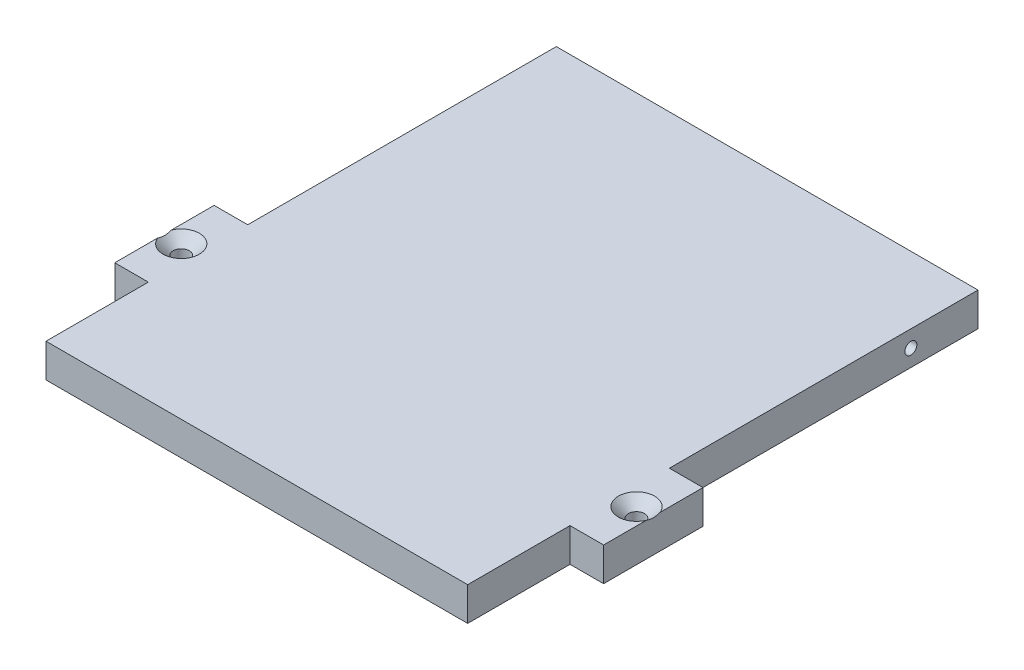
ISO-10303-21;
HEADER;
FILE_DESCRIPTION(('STEP AP214'),'2;1');
FILE_NAME('part.step','',(''),(''),'','','');
FILE_SCHEMA(('AUTOMOTIVE_DESIGN { 1 0 10303 214 1 1 1 1 }'));
ENDSEC;
DATA;
#1=APPLICATION_CONTEXT('core data for automotive mechanical design processes');
#2=APPLICATION_PROTOCOL_DEFINITION('international standard','automotive_design',2000,#1);
#3=PRODUCT_CONTEXT('',#1,'mechanical');
#4=PRODUCT('Part','Part','',(#3));
#5=PRODUCT_RELATED_PRODUCT_CATEGORY('part','',(#4));
#6=PRODUCT_DEFINITION_FORMATION('','',#4);
#7=PRODUCT_DEFINITION_CONTEXT('part definition',#1,'design');
#8=PRODUCT_DEFINITION('design','',#6,#7);
#9=PRODUCT_DEFINITION_SHAPE('','',#8);
#10=(LENGTH_UNIT() NAMED_UNIT(*) SI_UNIT(.MILLI.,.METRE.));
#11=(NAMED_UNIT(*) PLANE_ANGLE_UNIT() SI_UNIT($,.RADIAN.));
#12=(NAMED_UNIT(*) SI_UNIT($,.STERADIAN.) SOLID_ANGLE_UNIT());
#13=UNCERTAINTY_MEASURE_WITH_UNIT(LENGTH_MEASURE(1.E-05),#10,'distance_accuracy_value','');
#14=(GEOMETRIC_REPRESENTATION_CONTEXT(3) GLOBAL_UNCERTAINTY_ASSIGNED_CONTEXT((#13)) GLOBAL_UNIT_ASSIGNED_CONTEXT((#10,
#11,#12)) REPRESENTATION_CONTEXT('',''));
#15=CARTESIAN_POINT('',(0.,0.,0.));
#16=DIRECTION('',(0.,0.,1.));
#17=DIRECTION('',(1.,0.,0.));
#18=AXIS2_PLACEMENT_3D('',#15,#16,#17);
#19=CARTESIAN_POINT('',(39.6883770008071,6.35,-47.3190082823018));
#20=DIRECTION('',(1.,0.,0.));
#21=DIRECTION('',(0.,0.,-1.));
#22=AXIS2_PLACEMENT_3D('',#19,#20,#21);
#23=PLANE('',#22);
#24=DIRECTION('',(0.,0.,1.));
#25=VECTOR('',#24,1.);
#26=CARTESIAN_POINT('',(39.6883770008071,0.,-47.3190082823018));
#27=LINE('',#26,#25);
#28=CARTESIAN_POINT('',(39.6883770008071,0.,-96.2364061321356));
#29=VERTEX_POINT('',#28);
#30=CARTESIAN_POINT('',(39.688377000807,0.,-37.8672061321356));
#31=VERTEX_POINT('',#30);
#32=EDGE_CURVE('E333',#29,#31,#27,.T.);
#33=ORIENTED_EDGE('',*,*,#32,.F.);
#34=DIRECTION('',(0.,-1.,0.));
#35=VECTOR('',#34,1.);
#36=CARTESIAN_POINT('',(39.6883770008071,6.35,-96.2364061321356));
#37=LINE('',#36,#35);
#38=CARTESIAN_POINT('',(39.6883770008071,6.35,-96.2364061321356));
#39=VERTEX_POINT('',#38);
#40=EDGE_CURVE('E304',#39,#29,#37,.T.);
#41=ORIENTED_EDGE('',*,*,#40,.F.);
#42=DIRECTION('',(0.,0.,1.));
#43=VECTOR('',#42,1.);
#44=CARTESIAN_POINT('',(39.6883770008071,6.35,-47.3190082823018));
#45=LINE('',#44,#43);
#46=CARTESIAN_POINT('',(39.688377000807,6.35,-37.8672061321356));
#47=VERTEX_POINT('',#46);
#48=EDGE_CURVE('E157',#39,#47,#45,.T.);
#49=ORIENTED_EDGE('',*,*,#48,.T.);
#50=DIRECTION('',(0.,-1.,0.));
#51=VECTOR('',#50,1.);
#52=CARTESIAN_POINT('',(39.688377000807,6.35,-37.8672061321356));
#53=LINE('',#52,#51);
#54=EDGE_CURVE('E342',#47,#31,#53,.T.);
#55=ORIENTED_EDGE('',*,*,#54,.T.);
#56=EDGE_LOOP('',(#33,#41,#49,#55));
#57=FACE_BOUND('',#56,.T.);
#58=CARTESIAN_POINT('',(39.6883770008072,3.175,-83.5364061321355));
#59=DIRECTION('',(1.,0.,0.));
#60=DIRECTION('',(0.,0.,-1.));
#61=AXIS2_PLACEMENT_3D('',#58,#59,#60);
#62=CIRCLE('',#61,1.13029999999999);
#63=CARTESIAN_POINT('',(39.6883770008072,3.175,-84.6667061321355));
#64=VERTEX_POINT('',#63);
#65=EDGE_CURVE('E40',#64,#64,#62,.F.);
#66=ORIENTED_EDGE('',*,*,#65,.T.);
#67=EDGE_LOOP('',(#66));
#68=FACE_BOUND('',#67,.T.);
#69=ADVANCED_FACE('F35',(#57,#68),#23,.T.);
#70=CARTESIAN_POINT('',(-102.547126508136,6.35,-96.2364061321356));
#71=DIRECTION('',(0.,0.,1.));
#72=DIRECTION('',(1.,0.,0.));
#73=AXIS2_PLACEMENT_3D('',#70,#71,#72);
#74=PLANE('',#73);
#75=DIRECTION('',(-1.,0.,0.));
#76=VECTOR('',#75,1.);
#77=CARTESIAN_POINT('',(-102.547126508136,0.,-96.2364061321356));
#78=LINE('',#77,#76);
#79=CARTESIAN_POINT('',(-40.0676229991929,0.,-96.2364061321356));
#80=VERTEX_POINT('',#79);
#81=EDGE_CURVE('E163',#29,#80,#78,.T.);
#82=ORIENTED_EDGE('',*,*,#81,.T.);
#83=DIRECTION('',(0.,-1.,0.));
#84=VECTOR('',#83,1.);
#85=CARTESIAN_POINT('',(-40.0676229991929,6.35,-96.2364061321356));
#86=LINE('',#85,#84);
#87=CARTESIAN_POINT('',(-40.0676229991929,6.35,-96.2364061321356));
#88=VERTEX_POINT('',#87);
#89=EDGE_CURVE('E142',#88,#80,#86,.T.);
#90=ORIENTED_EDGE('',*,*,#89,.F.);
#91=DIRECTION('',(-1.,0.,0.));
#92=VECTOR('',#91,1.);
#93=CARTESIAN_POINT('',(-102.547126508136,6.35,-96.2364061321356));
#94=LINE('',#93,#92);
#95=EDGE_CURVE('E150',#39,#88,#94,.T.);
#96=ORIENTED_EDGE('',*,*,#95,.F.);
#97=ORIENTED_EDGE('',*,*,#40,.T.);
#98=EDGE_LOOP('',(#82,#90,#96,#97));
#99=FACE_BOUND('',#98,.T.);
#100=ADVANCED_FACE('F161',(#99),#74,.F.);
#101=CARTESIAN_POINT('',(-40.0676229991929,6.35,-47.3190082823024));
#102=DIRECTION('',(1.,0.,0.));
#103=DIRECTION('',(0.,0.,-1.));
#104=AXIS2_PLACEMENT_3D('',#101,#102,#103);
#105=PLANE('',#104);
#106=CARTESIAN_POINT('',(-40.0676229991929,3.175,-83.5364061321355));
#107=DIRECTION('',(-1.,0.,0.));
#108=DIRECTION('',(0.,0.,1.));
#109=AXIS2_PLACEMENT_3D('',#106,#107,#108);
#110=CIRCLE('',#109,1.13029999999999);
#111=CARTESIAN_POINT('',(-40.0676229991929,3.175,-82.4061061321356));
#112=VERTEX_POINT('',#111);
#113=EDGE_CURVE('E273',#112,#112,#110,.T.);
#114=ORIENTED_EDGE('',*,*,#113,.F.);
#115=EDGE_LOOP('',(#114));
#116=FACE_BOUND('',#115,.T.);
#117=DIRECTION('',(0.,0.,1.));
#118=VECTOR('',#117,1.);
#119=CARTESIAN_POINT('',(-40.0676229991929,0.,-47.3190082823024));
#120=LINE('',#119,#118);
#121=CARTESIAN_POINT('',(-40.0676229991928,0.,-37.8672061321356));
#122=VERTEX_POINT('',#121);
#123=EDGE_CURVE('E306',#80,#122,#120,.T.);
#124=ORIENTED_EDGE('',*,*,#123,.T.);
#125=DIRECTION('',(0.,-1.,0.));
#126=VECTOR('',#125,1.);
#127=CARTESIAN_POINT('',(-40.0676229991928,6.35,-37.8672061321356));
#128=LINE('',#127,#126);
#129=CARTESIAN_POINT('',(-40.0676229991928,6.35,-37.8672061321356));
#130=VERTEX_POINT('',#129);
#131=EDGE_CURVE('E145',#130,#122,#128,.T.);
#132=ORIENTED_EDGE('',*,*,#131,.F.);
#133=DIRECTION('',(0.,0.,1.));
#134=VECTOR('',#133,1.);
#135=CARTESIAN_POINT('',(-40.0676229991929,6.35,-47.3190082823024));
#136=LINE('',#135,#134);
#137=EDGE_CURVE('E138',#88,#130,#136,.T.);
#138=ORIENTED_EDGE('',*,*,#137,.F.);
#139=ORIENTED_EDGE('',*,*,#89,.T.);
#140=EDGE_LOOP('',(#124,#132,#138,#139));
#141=FACE_BOUND('',#140,.T.);
#142=ADVANCED_FACE('F140',(#116,#141),#105,.F.);
#143=CARTESIAN_POINT('',(-102.547126508136,6.35,-37.8672061321356));
#144=DIRECTION('',(0.,0.,1.));
#145=DIRECTION('',(1.,0.,0.));
#146=AXIS2_PLACEMENT_3D('',#143,#144,#145);
#147=PLANE('',#146);
#148=DIRECTION('',(-1.,0.,0.));
#149=VECTOR('',#148,1.);
#150=CARTESIAN_POINT('',(-102.547126508136,0.,-37.8672061321356));
#151=LINE('',#150,#149);
#152=CARTESIAN_POINT('',(-46.4176229991928,0.,-37.8672061321356));
#153=VERTEX_POINT('',#152);
#154=EDGE_CURVE('E308',#122,#153,#151,.T.);
#155=ORIENTED_EDGE('',*,*,#154,.T.);
#156=DIRECTION('',(0.,-1.,0.));
#157=VECTOR('',#156,1.);
#158=CARTESIAN_POINT('',(-46.4176229991928,6.35,-37.8672061321356));
#159=LINE('',#158,#157);
#160=CARTESIAN_POINT('',(-46.4176229991928,6.35,-37.8672061321356));
#161=VERTEX_POINT('',#160);
#162=EDGE_CURVE('E169',#161,#153,#159,.T.);
#163=ORIENTED_EDGE('',*,*,#162,.F.);
#164=DIRECTION('',(-1.,0.,0.));
#165=VECTOR('',#164,1.);
#166=CARTESIAN_POINT('',(-102.547126508136,6.35,-37.8672061321356));
#167=LINE('',#166,#165);
#168=EDGE_CURVE('E149',#130,#161,#167,.T.);
#169=ORIENTED_EDGE('',*,*,#168,.F.);
#170=ORIENTED_EDGE('',*,*,#131,.T.);
#171=EDGE_LOOP('',(#155,#163,#169,#170));
#172=FACE_BOUND('',#171,.T.);
#173=ADVANCED_FACE('F219',(#172),#147,.F.);
#174=CARTESIAN_POINT('',(-46.4176229991928,6.35,-47.3190082823023));
#175=DIRECTION('',(-1.,0.,0.));
#176=DIRECTION('',(0.,0.,1.));
#177=AXIS2_PLACEMENT_3D('',#174,#175,#176);
#178=PLANE('',#177);
#179=DIRECTION('',(0.,0.,-1.));
#180=VECTOR('',#179,1.);
#181=CARTESIAN_POINT('',(-46.4176229991928,6.35,-47.3190082823023));
#182=LINE('',#181,#180);
#183=CARTESIAN_POINT('',(-46.4176229991929,6.35,-19.0712061321356));
#184=VERTEX_POINT('',#183);
#185=CARTESIAN_POINT('',(-46.4176229991928,6.35,-27.174055175683));
#186=VERTEX_POINT('',#185);
#187=EDGE_CURVE('E282',#184,#186,#182,.T.);
#188=ORIENTED_EDGE('',*,*,#187,.T.);
#189=CARTESIAN_POINT('',(-46.4176229991928,6.35,-27.174055175683));
#190=CARTESIAN_POINT('',(-46.4176229991928,6.31111456805667,-27.2769388961666));
#191=CARTESIAN_POINT('',(-46.4176229991928,6.27570288432137,-27.3812603931163));
#192=CARTESIAN_POINT('',(-46.4176229991928,6.21323262229652,-27.5926541140827));
#193=CARTESIAN_POINT('',(-46.4176229991928,6.18619614019412,-27.6997328206307));
#194=CARTESIAN_POINT('',(-46.4176229991928,6.14288691578827,-27.9121195594745));
#195=CARTESIAN_POINT('',(-46.4176229991928,6.12626484364899,-28.0173546516018));
#196=CARTESIAN_POINT('',(-46.4176229991928,6.10335509585119,-28.228823161426));
#197=CARTESIAN_POINT('',(-46.4176229991928,6.09705404783173,-28.3350551076859));
#198=CARTESIAN_POINT('',(-46.4176229991928,6.09515139753152,-28.552087665572));
#199=CARTESIAN_POINT('',(-46.4176229991928,6.10001056558474,-28.6628926598915));
#200=CARTESIAN_POINT('',(-46.4176229991928,6.12103457209278,-28.8835631375796));
#201=CARTESIAN_POINT('',(-46.4176229991928,6.13721555492847,-28.9934270522855));
#202=CARTESIAN_POINT('',(-46.4176229991928,6.18059889062465,-29.2152961394401));
#203=CARTESIAN_POINT('',(-46.4176229991928,6.20820141409091,-29.3272210129955));
#204=CARTESIAN_POINT('',(-46.4176229991928,6.27262414248632,-29.5480713437992));
#205=CARTESIAN_POINT('',(-46.4176229991928,6.30941862852149,-29.6570042440712));
#206=CARTESIAN_POINT('',(-46.4176229991928,6.35,-29.7643570885882));
#207=B_SPLINE_CURVE_WITH_KNOTS('',3,(#189,#190,#191,#192,#193,#194,#195,#196,#197,#198,#199,
#200,#201,#202,#203,#204,#205,#206),.UNSPECIFIED.,.F.,.F.,(4,2,2,2,2,2,2,2,4),(0.,
0.330075385219527,0.661014329794229,0.980156657333872,1.29888516238657,1.63100817160978,
1.96360574050835,2.30900260410894,2.65344367215088),.UNSPECIFIED.);
#208=CARTESIAN_POINT('',(-46.4176229991928,6.35,-29.7643570885882));
#209=VERTEX_POINT('',#208);
#210=EDGE_CURVE('E45',#186,#209,#207,.T.);
#211=ORIENTED_EDGE('',*,*,#210,.T.);
#212=EDGE_CURVE('E281',#209,#161,#182,.T.);
#213=ORIENTED_EDGE('',*,*,#212,.T.);
#214=ORIENTED_EDGE('',*,*,#162,.T.);
#215=DIRECTION('',(0.,0.,-1.));
#216=VECTOR('',#215,1.);
#217=CARTESIAN_POINT('',(-46.4176229991928,0.,-47.3190082823023));
#218=LINE('',#217,#216);
#219=CARTESIAN_POINT('',(-46.4176229991929,0.,-19.0712061321356));
#220=VERTEX_POINT('',#219);
#221=EDGE_CURVE('E311',#220,#153,#218,.T.);
#222=ORIENTED_EDGE('',*,*,#221,.F.);
#223=DIRECTION('',(0.,-1.,0.));
#224=VECTOR('',#223,1.);
#225=CARTESIAN_POINT('',(-46.4176229991929,6.35,-19.0712061321356));
#226=LINE('',#225,#224);
#227=EDGE_CURVE('E358',#184,#220,#226,.T.);
#228=ORIENTED_EDGE('',*,*,#227,.F.);
#229=EDGE_LOOP('',(#188,#211,#213,#214,#222,#228));
#230=FACE_BOUND('',#229,.T.);
#231=ADVANCED_FACE('F214',(#230),#178,.T.);
#232=CARTESIAN_POINT('',(-102.547126508136,6.35,-19.0712061321356));
#233=DIRECTION('',(0.,0.,-1.));
#234=DIRECTION('',(-1.,0.,0.));
#235=AXIS2_PLACEMENT_3D('',#232,#233,#234);
#236=PLANE('',#235);
#237=DIRECTION('',(1.,0.,0.));
#238=VECTOR('',#237,1.);
#239=CARTESIAN_POINT('',(-102.547126508136,0.,-19.0712061321356));
#240=LINE('',#239,#238);
#241=CARTESIAN_POINT('',(-40.0676229991928,0.,-19.0712061321356));
#242=VERTEX_POINT('',#241);
#243=EDGE_CURVE('E314',#220,#242,#240,.T.);
#244=ORIENTED_EDGE('',*,*,#243,.T.);
#245=DIRECTION('',(0.,-1.,0.));
#246=VECTOR('',#245,1.);
#247=CARTESIAN_POINT('',(-40.0676229991928,6.35,-19.0712061321356));
#248=LINE('',#247,#246);
#249=CARTESIAN_POINT('',(-40.0676229991928,6.35,-19.0712061321356));
#250=VERTEX_POINT('',#249);
#251=EDGE_CURVE('E355',#250,#242,#248,.T.);
#252=ORIENTED_EDGE('',*,*,#251,.F.);
#253=DIRECTION('',(1.,0.,0.));
#254=VECTOR('',#253,1.);
#255=CARTESIAN_POINT('',(-102.547126508136,6.35,-19.0712061321356));
#256=LINE('',#255,#254);
#257=EDGE_CURVE('E285',#184,#250,#256,.T.);
#258=ORIENTED_EDGE('',*,*,#257,.F.);
#259=ORIENTED_EDGE('',*,*,#227,.T.);
#260=EDGE_LOOP('',(#244,#252,#258,#259));
#261=FACE_BOUND('',#260,.T.);
#262=ADVANCED_FACE('F211',(#261),#236,.F.);
#263=CARTESIAN_POINT('',(-40.0676229991928,6.35,-47.3190082823025));
#264=DIRECTION('',(1.,0.,0.));
#265=DIRECTION('',(0.,0.,-1.));
#266=AXIS2_PLACEMENT_3D('',#263,#264,#265);
#267=PLANE('',#266);
#268=DIRECTION('',(0.,0.,1.));
#269=VECTOR('',#268,1.);
#270=CARTESIAN_POINT('',(-40.0676229991928,0.,-47.3190082823025));
#271=LINE('',#270,#269);
#272=CARTESIAN_POINT('',(-40.0676229991928,0.,0.283593867864403));
#273=VERTEX_POINT('',#272);
#274=EDGE_CURVE('E316',#242,#273,#271,.T.);
#275=ORIENTED_EDGE('',*,*,#274,.T.);
#276=DIRECTION('',(0.,-1.,0.));
#277=VECTOR('',#276,1.);
#278=CARTESIAN_POINT('',(-40.0676229991928,6.35,0.283593867864403));
#279=LINE('',#278,#277);
#280=CARTESIAN_POINT('',(-40.0676229991928,6.35,0.283593867864403));
#281=VERTEX_POINT('',#280);
#282=EDGE_CURVE('E352',#281,#273,#279,.T.);
#283=ORIENTED_EDGE('',*,*,#282,.F.);
#284=DIRECTION('',(0.,0.,1.));
#285=VECTOR('',#284,1.);
#286=CARTESIAN_POINT('',(-40.0676229991928,6.35,-47.3190082823025));
#287=LINE('',#286,#285);
#288=EDGE_CURVE('E287',#250,#281,#287,.T.);
#289=ORIENTED_EDGE('',*,*,#288,.F.);
#290=ORIENTED_EDGE('',*,*,#251,.T.);
#291=EDGE_LOOP('',(#275,#283,#289,#290));
#292=FACE_BOUND('',#291,.T.);
#293=ADVANCED_FACE('F207',(#292),#267,.F.);
#294=CARTESIAN_POINT('',(-102.547126508136,6.35,0.283593867864411));
#295=DIRECTION('',(0.,0.,-1.));
#296=DIRECTION('',(-1.,0.,0.));
#297=AXIS2_PLACEMENT_3D('',#294,#295,#296);
#298=PLANE('',#297);
#299=DIRECTION('',(1.,0.,0.));
#300=VECTOR('',#299,1.);
#301=CARTESIAN_POINT('',(-102.547126508136,0.,0.283593867864411));
#302=LINE('',#301,#300);
#303=CARTESIAN_POINT('',(39.688377000807,0.,0.283593867864394));
#304=VERTEX_POINT('',#303);
#305=EDGE_CURVE('E318',#273,#304,#302,.T.);
#306=ORIENTED_EDGE('',*,*,#305,.T.);
#307=DIRECTION('',(0.,-1.,0.));
#308=VECTOR('',#307,1.);
#309=CARTESIAN_POINT('',(39.688377000807,6.35,0.283593867864394));
#310=LINE('',#309,#308);
#311=CARTESIAN_POINT('',(39.688377000807,6.35,0.283593867864394));
#312=VERTEX_POINT('',#311);
#313=EDGE_CURVE('E350',#312,#304,#310,.T.);
#314=ORIENTED_EDGE('',*,*,#313,.F.);
#315=DIRECTION('',(1.,0.,0.));
#316=VECTOR('',#315,1.);
#317=CARTESIAN_POINT('',(-102.547126508136,6.35,0.283593867864411));
#318=LINE('',#317,#316);
#319=EDGE_CURVE('E289',#281,#312,#318,.T.);
#320=ORIENTED_EDGE('',*,*,#319,.F.);
#321=ORIENTED_EDGE('',*,*,#282,.T.);
#322=EDGE_LOOP('',(#306,#314,#320,#321));
#323=FACE_BOUND('',#322,.T.);
#324=ADVANCED_FACE('F203',(#323),#298,.F.);
#325=CARTESIAN_POINT('',(39.688377000807,6.35,-47.3190082823023));
#326=DIRECTION('',(1.,0.,0.));
#327=DIRECTION('',(0.,0.,-1.));
#328=AXIS2_PLACEMENT_3D('',#325,#326,#327);
#329=PLANE('',#328);
#330=DIRECTION('',(0.,0.,1.));
#331=VECTOR('',#330,1.);
#332=CARTESIAN_POINT('',(39.688377000807,0.,-47.3190082823023));
#333=LINE('',#332,#331);
#334=CARTESIAN_POINT('',(39.688377000807,0.,-19.0712061321356));
#335=VERTEX_POINT('',#334);
#336=EDGE_CURVE('E321',#335,#304,#333,.T.);
#337=ORIENTED_EDGE('',*,*,#336,.F.);
#338=DIRECTION('',(0.,-1.,0.));
#339=VECTOR('',#338,1.);
#340=CARTESIAN_POINT('',(39.688377000807,6.35,-19.0712061321356));
#341=LINE('',#340,#339);
#342=CARTESIAN_POINT('',(39.688377000807,6.35,-19.0712061321356));
#343=VERTEX_POINT('',#342);
#344=EDGE_CURVE('E348',#343,#335,#341,.T.);
#345=ORIENTED_EDGE('',*,*,#344,.F.);
#346=DIRECTION('',(0.,0.,1.));
#347=VECTOR('',#346,1.);
#348=CARTESIAN_POINT('',(39.688377000807,6.35,-47.3190082823023));
#349=LINE('',#348,#347);
#350=EDGE_CURVE('E291',#343,#312,#349,.T.);
#351=ORIENTED_EDGE('',*,*,#350,.T.);
#352=ORIENTED_EDGE('',*,*,#313,.T.);
#353=EDGE_LOOP('',(#337,#345,#351,#352));
#354=FACE_BOUND('',#353,.T.);
#355=ADVANCED_FACE('F199',(#354),#329,.T.);
#356=CARTESIAN_POINT('',(-102.547126508136,6.35,-19.0712061321356));
#357=DIRECTION('',(0.,0.,1.));
#358=DIRECTION('',(1.,0.,0.));
#359=AXIS2_PLACEMENT_3D('',#356,#357,#358);
#360=PLANE('',#359);
#361=DIRECTION('',(-1.,0.,0.));
#362=VECTOR('',#361,1.);
#363=CARTESIAN_POINT('',(-102.547126508136,0.,-19.0712061321356));
#364=LINE('',#363,#362);
#365=CARTESIAN_POINT('',(46.038377000807,0.,-19.0712061321356));
#366=VERTEX_POINT('',#365);
#367=EDGE_CURVE('E324',#366,#335,#364,.T.);
#368=ORIENTED_EDGE('',*,*,#367,.F.);
#369=DIRECTION('',(0.,-1.,0.));
#370=VECTOR('',#369,1.);
#371=CARTESIAN_POINT('',(46.038377000807,6.35,-19.0712061321356));
#372=LINE('',#371,#370);
#373=CARTESIAN_POINT('',(46.038377000807,6.35,-19.0712061321356));
#374=VERTEX_POINT('',#373);
#375=EDGE_CURVE('E346',#374,#366,#372,.T.);
#376=ORIENTED_EDGE('',*,*,#375,.F.);
#377=DIRECTION('',(-1.,0.,0.));
#378=VECTOR('',#377,1.);
#379=CARTESIAN_POINT('',(-102.547126508136,6.35,-19.0712061321356));
#380=LINE('',#379,#378);
#381=EDGE_CURVE('E294',#374,#343,#380,.T.);
#382=ORIENTED_EDGE('',*,*,#381,.T.);
#383=ORIENTED_EDGE('',*,*,#344,.T.);
#384=EDGE_LOOP('',(#368,#376,#382,#383));
#385=FACE_BOUND('',#384,.T.);
#386=ADVANCED_FACE('F195',(#385),#360,.T.);
#387=CARTESIAN_POINT('',(46.038377000807,6.35,-47.3190082823026));
#388=DIRECTION('',(-1.,0.,0.));
#389=DIRECTION('',(0.,0.,1.));
#390=AXIS2_PLACEMENT_3D('',#387,#388,#389);
#391=PLANE('',#390);
#392=DIRECTION('',(0.,0.,-1.));
#393=VECTOR('',#392,1.);
#394=CARTESIAN_POINT('',(46.038377000807,6.35,-47.3190082823026));
#395=LINE('',#394,#393);
#396=CARTESIAN_POINT('',(46.038377000807,6.35,-29.7643570885881));
#397=VERTEX_POINT('',#396);
#398=CARTESIAN_POINT('',(46.038377000807,6.35,-37.8672061321356));
#399=VERTEX_POINT('',#398);
#400=EDGE_CURVE('E297',#397,#399,#395,.T.);
#401=ORIENTED_EDGE('',*,*,#400,.F.);
#402=CARTESIAN_POINT('',(46.038377000807,6.35,-29.7643570885881));
#403=CARTESIAN_POINT('',(46.038377000807,6.31111456805667,-29.6614733681046));
#404=CARTESIAN_POINT('',(46.038377000807,6.27570288432137,-29.5571518711549));
#405=CARTESIAN_POINT('',(46.038377000807,6.21323262229653,-29.3457581501885));
#406=CARTESIAN_POINT('',(46.038377000807,6.18619614019413,-29.2386794436405));
#407=CARTESIAN_POINT('',(46.038377000807,6.14288691578829,-29.0262927047967));
#408=CARTESIAN_POINT('',(46.038377000807,6.12626484364901,-28.9210576126694));
#409=CARTESIAN_POINT('',(46.038377000807,6.10335509585121,-28.7095891028452));
#410=CARTESIAN_POINT('',(46.038377000807,6.09705404783176,-28.6033571565853));
#411=CARTESIAN_POINT('',(46.038377000807,6.09515139753155,-28.3863245986992));
#412=CARTESIAN_POINT('',(46.038377000807,6.10001056558478,-28.2755196043797));
#413=CARTESIAN_POINT('',(46.038377000807,6.12103457209281,-28.0548491266917));
#414=CARTESIAN_POINT('',(46.038377000807,6.1372155549285,-27.9449852119857));
#415=CARTESIAN_POINT('',(46.038377000807,6.18059889062467,-27.7231161248312));
#416=CARTESIAN_POINT('',(46.038377000807,6.20820141409093,-27.6111912512758));
#417=CARTESIAN_POINT('',(46.038377000807,6.27262414248633,-27.3903409204721));
#418=CARTESIAN_POINT('',(46.038377000807,6.3094186285215,-27.2814080202001));
#419=CARTESIAN_POINT('',(46.038377000807,6.35,-27.1740551756831));
#420=B_SPLINE_CURVE_WITH_KNOTS('',3,(#402,#403,#404,#405,#406,#407,#408,#409,#410,#411,#412,
#413,#414,#415,#416,#417,#418,#419),.UNSPECIFIED.,.F.,.F.,(4,2,2,2,2,2,2,2,4),(0.,
0.330075385219521,0.661014329794214,0.980156657333852,1.29888516238655,1.63100817160973,
1.96360574050826,2.30900260410882,2.65344367215073),.UNSPECIFIED.);
#421=CARTESIAN_POINT('',(46.038377000807,6.35,-27.1740551756831));
#422=VERTEX_POINT('',#421);
#423=EDGE_CURVE('E51',#397,#422,#420,.T.);
#424=ORIENTED_EDGE('',*,*,#423,.T.);
#425=EDGE_CURVE('E298',#374,#422,#395,.T.);
#426=ORIENTED_EDGE('',*,*,#425,.F.);
#427=ORIENTED_EDGE('',*,*,#375,.T.);
#428=DIRECTION('',(0.,0.,-1.));
#429=VECTOR('',#428,1.);
#430=CARTESIAN_POINT('',(46.038377000807,0.,-47.3190082823026));
#431=LINE('',#430,#429);
#432=CARTESIAN_POINT('',(46.038377000807,0.,-37.8672061321356));
#433=VERTEX_POINT('',#432);
#434=EDGE_CURVE('E327',#366,#433,#431,.T.);
#435=ORIENTED_EDGE('',*,*,#434,.T.);
#436=DIRECTION('',(0.,-1.,0.));
#437=VECTOR('',#436,1.);
#438=CARTESIAN_POINT('',(46.038377000807,6.35,-37.8672061321356));
#439=LINE('',#438,#437);
#440=EDGE_CURVE('E344',#399,#433,#439,.T.);
#441=ORIENTED_EDGE('',*,*,#440,.F.);
#442=EDGE_LOOP('',(#401,#424,#426,#427,#435,#441));
#443=FACE_BOUND('',#442,.T.);
#444=ADVANCED_FACE('F189',(#443),#391,.F.);
#445=CARTESIAN_POINT('',(-102.547126508136,6.35,-37.8672061321354));
#446=DIRECTION('',(0.,0.,-1.));
#447=DIRECTION('',(-1.,0.,0.));
#448=AXIS2_PLACEMENT_3D('',#445,#446,#447);
#449=PLANE('',#448);
#450=DIRECTION('',(1.,0.,0.));
#451=VECTOR('',#450,1.);
#452=CARTESIAN_POINT('',(-102.547126508136,0.,-37.8672061321354));
#453=LINE('',#452,#451);
#454=EDGE_CURVE('E330',#31,#433,#453,.T.);
#455=ORIENTED_EDGE('',*,*,#454,.F.);
#456=ORIENTED_EDGE('',*,*,#54,.F.);
#457=DIRECTION('',(1.,0.,0.));
#458=VECTOR('',#457,1.);
#459=CARTESIAN_POINT('',(-102.547126508136,6.35,-37.8672061321354));
#460=LINE('',#459,#458);
#461=EDGE_CURVE('E300',#47,#399,#460,.T.);
#462=ORIENTED_EDGE('',*,*,#461,.T.);
#463=ORIENTED_EDGE('',*,*,#440,.T.);
#464=EDGE_LOOP('',(#455,#456,#462,#463));
#465=FACE_BOUND('',#464,.T.);
#466=ADVANCED_FACE('F194',(#465),#449,.T.);
#467=CARTESIAN_POINT('',(42.863377000807,6.35,-28.4692061321356));
#468=DIRECTION('',(0.,-1.,0.));
#469=DIRECTION('',(0.,0.,-1.));
#470=AXIS2_PLACEMENT_3D('',#467,#468,#469);
#471=CYLINDRICAL_SURFACE('',#470,1.524);
#472=CARTESIAN_POINT('',(42.863377000807,4.44499999999999,-28.4692061321356));
#473=DIRECTION('',(0.,1.,0.));
#474=DIRECTION('',(0.,0.,1.));
#475=AXIS2_PLACEMENT_3D('',#472,#473,#474);
#476=CIRCLE('',#475,1.524);
#477=CARTESIAN_POINT('',(42.863377000807,4.44499999999999,-26.9452061321356));
#478=VERTEX_POINT('',#477);
#479=EDGE_CURVE('E164',#478,#478,#476,.T.);
#480=ORIENTED_EDGE('',*,*,#479,.T.);
#481=EDGE_LOOP('',(#480));
#482=FACE_BOUND('',#481,.T.);
#483=CARTESIAN_POINT('',(42.863377000807,0.,-28.4692061321356));
#484=DIRECTION('',(0.,1.,0.));
#485=DIRECTION('',(0.,0.,1.));
#486=AXIS2_PLACEMENT_3D('',#483,#484,#485);
#487=CIRCLE('',#486,1.524);
#488=CARTESIAN_POINT('',(42.863377000807,0.,-26.9452061321356));
#489=VERTEX_POINT('',#488);
#490=EDGE_CURVE('E336',#489,#489,#487,.T.);
#491=ORIENTED_EDGE('',*,*,#490,.F.);
#492=EDGE_LOOP('',(#491));
#493=FACE_BOUND('',#492,.T.);
#494=ADVANCED_FACE('F236',(#482,#493),#471,.F.);
#495=CARTESIAN_POINT('',(-43.2426229991928,6.35,-28.4692061321356));
#496=DIRECTION('',(0.,-1.,0.));
#497=DIRECTION('',(0.,0.,-1.));
#498=AXIS2_PLACEMENT_3D('',#495,#496,#497);
#499=CYLINDRICAL_SURFACE('',#498,1.524);
#500=CARTESIAN_POINT('',(-43.2426229991928,4.44499999999998,-28.4692061321356));
#501=DIRECTION('',(0.,1.,0.));
#502=DIRECTION('',(0.,0.,1.));
#503=AXIS2_PLACEMENT_3D('',#500,#501,#502);
#504=CIRCLE('',#503,1.524);
#505=CARTESIAN_POINT('',(-43.2426229991928,4.44499999999998,-26.9452061321356));
#506=VERTEX_POINT('',#505);
#507=EDGE_CURVE('E11',#506,#506,#504,.T.);
#508=ORIENTED_EDGE('',*,*,#507,.T.);
#509=EDGE_LOOP('',(#508));
#510=FACE_BOUND('',#509,.T.);
#511=CARTESIAN_POINT('',(-43.2426229991928,0.,-28.4692061321356));
#512=DIRECTION('',(0.,1.,0.));
#513=DIRECTION('',(0.,0.,1.));
#514=AXIS2_PLACEMENT_3D('',#511,#512,#513);
#515=CIRCLE('',#514,1.524);
#516=CARTESIAN_POINT('',(-43.2426229991928,0.,-26.9452061321356));
#517=VERTEX_POINT('',#516);
#518=EDGE_CURVE('E159',#517,#517,#515,.F.);
#519=ORIENTED_EDGE('',*,*,#518,.T.);
#520=EDGE_LOOP('',(#519));
#521=FACE_BOUND('',#520,.T.);
#522=ADVANCED_FACE('F239',(#510,#521),#499,.F.);
#523=CARTESIAN_POINT('',(-102.547126508136,6.35,-47.3190082823024));
#524=DIRECTION('',(0.,1.,0.));
#525=DIRECTION('',(0.,0.,1.));
#526=AXIS2_PLACEMENT_3D('',#523,#524,#525);
#527=PLANE('',#526);
#528=ORIENTED_EDGE('',*,*,#425,.T.);
#529=CARTESIAN_POINT('',(42.863377000807,6.35,-28.4692061321356));
#530=DIRECTION('',(0.,1.,0.));
#531=DIRECTION('',(0.,0.,1.));
#532=AXIS2_PLACEMENT_3D('',#529,#530,#531);
#533=CIRCLE('',#532,3.429);
#534=EDGE_CURVE('E175',#422,#397,#533,.F.);
#535=ORIENTED_EDGE('',*,*,#534,.T.);
#536=ORIENTED_EDGE('',*,*,#400,.T.);
#537=ORIENTED_EDGE('',*,*,#461,.F.);
#538=ORIENTED_EDGE('',*,*,#48,.F.);
#539=ORIENTED_EDGE('',*,*,#95,.T.);
#540=ORIENTED_EDGE('',*,*,#137,.T.);
#541=ORIENTED_EDGE('',*,*,#168,.T.);
#542=ORIENTED_EDGE('',*,*,#212,.F.);
#543=CARTESIAN_POINT('',(-43.2426229991928,6.35,-28.4692061321356));
#544=DIRECTION('',(0.,1.,0.));
#545=DIRECTION('',(0.,0.,1.));
#546=AXIS2_PLACEMENT_3D('',#543,#544,#545);
#547=CIRCLE('',#546,3.429);
#548=EDGE_CURVE('E167',#209,#186,#547,.F.);
#549=ORIENTED_EDGE('',*,*,#548,.T.);
#550=ORIENTED_EDGE('',*,*,#187,.F.);
#551=ORIENTED_EDGE('',*,*,#257,.T.);
#552=ORIENTED_EDGE('',*,*,#288,.T.);
#553=ORIENTED_EDGE('',*,*,#319,.T.);
#554=ORIENTED_EDGE('',*,*,#350,.F.);
#555=ORIENTED_EDGE('',*,*,#381,.F.);
#556=EDGE_LOOP('',(#528,#535,#536,#537,#538,#539,#540,#541,#542,#549,#550,#551,#552,#553,#554,#555));
#557=FACE_BOUND('',#556,.T.);
#558=ADVANCED_FACE('F154',(#557),#527,.T.);
#559=CARTESIAN_POINT('',(-102.547126508136,0.,-47.3190082823024));
#560=DIRECTION('',(0.,1.,0.));
#561=DIRECTION('',(0.,0.,1.));
#562=AXIS2_PLACEMENT_3D('',#559,#560,#561);
#563=PLANE('',#562);
#564=ORIENTED_EDGE('',*,*,#81,.F.);
#565=ORIENTED_EDGE('',*,*,#32,.T.);
#566=ORIENTED_EDGE('',*,*,#454,.T.);
#567=ORIENTED_EDGE('',*,*,#434,.F.);
#568=ORIENTED_EDGE('',*,*,#367,.T.);
#569=ORIENTED_EDGE('',*,*,#336,.T.);
#570=ORIENTED_EDGE('',*,*,#305,.F.);
#571=ORIENTED_EDGE('',*,*,#274,.F.);
#572=ORIENTED_EDGE('',*,*,#243,.F.);
#573=ORIENTED_EDGE('',*,*,#221,.T.);
#574=ORIENTED_EDGE('',*,*,#154,.F.);
#575=ORIENTED_EDGE('',*,*,#123,.F.);
#576=EDGE_LOOP('',(#564,#565,#566,#567,#568,#569,#570,#571,#572,#573,#574,#575));
#577=FACE_BOUND('',#576,.T.);
#578=ORIENTED_EDGE('',*,*,#490,.T.);
#579=EDGE_LOOP('',(#578));
#580=FACE_BOUND('',#579,.T.);
#581=ORIENTED_EDGE('',*,*,#518,.F.);
#582=EDGE_LOOP('',(#581));
#583=FACE_BOUND('',#582,.T.);
#584=ADVANCED_FACE('F244',(#577,#580,#583),#563,.F.);
#585=CARTESIAN_POINT('',(42.863377000807,4.44499999999999,-28.4692061321356));
#586=DIRECTION('',(0.,1.,0.));
#587=DIRECTION('',(0.,0.,1.));
#588=AXIS2_PLACEMENT_3D('',#585,#586,#587);
#589=CONICAL_SURFACE('',#588,1.524,0.785398163397447);
#590=ORIENTED_EDGE('',*,*,#423,.F.);
#591=ORIENTED_EDGE('',*,*,#534,.F.);
#592=EDGE_LOOP('',(#590,#591));
#593=FACE_BOUND('',#592,.T.);
#594=ORIENTED_EDGE('',*,*,#479,.F.);
#595=EDGE_LOOP('',(#594));
#596=FACE_BOUND('',#595,.T.);
#597=ADVANCED_FACE('F186',(#593,#596),#589,.F.);
#598=CARTESIAN_POINT('',(-43.2426229991928,6.35,-28.4692061321356));
#599=DIRECTION('',(0.,1.,0.));
#600=DIRECTION('',(0.,0.,1.));
#601=AXIS2_PLACEMENT_3D('',#598,#599,#600);
#602=CONICAL_SURFACE('',#601,3.429,0.785398163397443);
#603=ORIENTED_EDGE('',*,*,#507,.F.);
#604=EDGE_LOOP('',(#603));
#605=FACE_BOUND('',#604,.T.);
#606=ORIENTED_EDGE('',*,*,#210,.F.);
#607=ORIENTED_EDGE('',*,*,#548,.F.);
#608=EDGE_LOOP('',(#606,#607));
#609=FACE_BOUND('',#608,.T.);
#610=ADVANCED_FACE('F37',(#605,#609),#602,.F.);
#611=CARTESIAN_POINT('',(-27.3676229991929,3.175,-83.5364061321356));
#612=DIRECTION('',(-1.,0.,0.));
#613=DIRECTION('',(0.,0.,1.));
#614=AXIS2_PLACEMENT_3D('',#611,#612,#613);
#615=CYLINDRICAL_SURFACE('',#614,1.13029999999999);
#616=CARTESIAN_POINT('',(-27.3676229991929,3.175,-83.5364061321356));
#617=DIRECTION('',(-1.,0.,0.));
#618=DIRECTION('',(0.,0.,1.));
#619=AXIS2_PLACEMENT_3D('',#616,#617,#618);
#620=CIRCLE('',#619,1.13029999999999);
#621=CARTESIAN_POINT('',(-27.3676229991929,3.175,-82.4061061321356));
#622=VERTEX_POINT('',#621);
#623=EDGE_CURVE('E275',#622,#622,#620,.T.);
#624=ORIENTED_EDGE('',*,*,#623,.F.);
#625=EDGE_LOOP('',(#624));
#626=FACE_BOUND('',#625,.T.);
#627=ORIENTED_EDGE('',*,*,#113,.T.);
#628=EDGE_LOOP('',(#627));
#629=FACE_BOUND('',#628,.T.);
#630=ADVANCED_FACE('F250',(#626,#629),#615,.F.);
#631=CARTESIAN_POINT('',(-27.3676229991929,3.175,-83.5364061321356));
#632=DIRECTION('',(-1.,0.,0.));
#633=DIRECTION('',(0.,0.,1.));
#634=AXIS2_PLACEMENT_3D('',#631,#632,#633);
#635=PLANE('',#634);
#636=ORIENTED_EDGE('',*,*,#623,.T.);
#637=EDGE_LOOP('',(#636));
#638=FACE_BOUND('',#637,.T.);
#639=ADVANCED_FACE('F253',(#638),#635,.T.);
#640=CARTESIAN_POINT('',(27.3676229991929,3.175,-83.5364061321356));
#641=DIRECTION('',(1.,0.,0.));
#642=DIRECTION('',(0.,0.,-1.));
#643=AXIS2_PLACEMENT_3D('',#640,#641,#642);
#644=CYLINDRICAL_SURFACE('',#643,1.13029999999999);
#645=ORIENTED_EDGE('',*,*,#65,.F.);
#646=EDGE_LOOP('',(#645));
#647=FACE_BOUND('',#646,.T.);
#648=CARTESIAN_POINT('',(27.3676229991929,3.175,-83.5364061321356));
#649=DIRECTION('',(-1.,0.,0.));
#650=DIRECTION('',(0.,0.,1.));
#651=AXIS2_PLACEMENT_3D('',#648,#649,#650);
#652=CIRCLE('',#651,1.13029999999999);
#653=CARTESIAN_POINT('',(27.3676229991929,3.175,-82.4061061321356));
#654=VERTEX_POINT('',#653);
#655=EDGE_CURVE('E269',#654,#654,#652,.T.);
#656=ORIENTED_EDGE('',*,*,#655,.T.);
#657=EDGE_LOOP('',(#656));
#658=FACE_BOUND('',#657,.T.);
#659=ADVANCED_FACE('F257',(#647,#658),#644,.F.);
#660=CARTESIAN_POINT('',(27.3676229991929,3.175,-83.5364061321356));
#661=DIRECTION('',(1.,0.,0.));
#662=DIRECTION('',(0.,0.,1.));
#663=AXIS2_PLACEMENT_3D('',#660,#661,#662);
#664=PLANE('',#663);
#665=ORIENTED_EDGE('',*,*,#655,.F.);
#666=EDGE_LOOP('',(#665));
#667=FACE_BOUND('',#666,.T.);
#668=ADVANCED_FACE('F261',(#667),#664,.T.);
#669=CLOSED_SHELL('',(#69,#100,#142,#173,#231,#262,#293,#324,#355,#386,#444,#466,#494,#522,#558,
#584,#597,#610,#630,#639,#659,#668));
#670=MANIFOLD_SOLID_BREP('B2',#669);
#671=ADVANCED_BREP_SHAPE_REPRESENTATION('',(#18,#670),#14);
#672=SHAPE_DEFINITION_REPRESENTATION(#9,#671);
ENDSEC;
END-ISO-10303-21;
